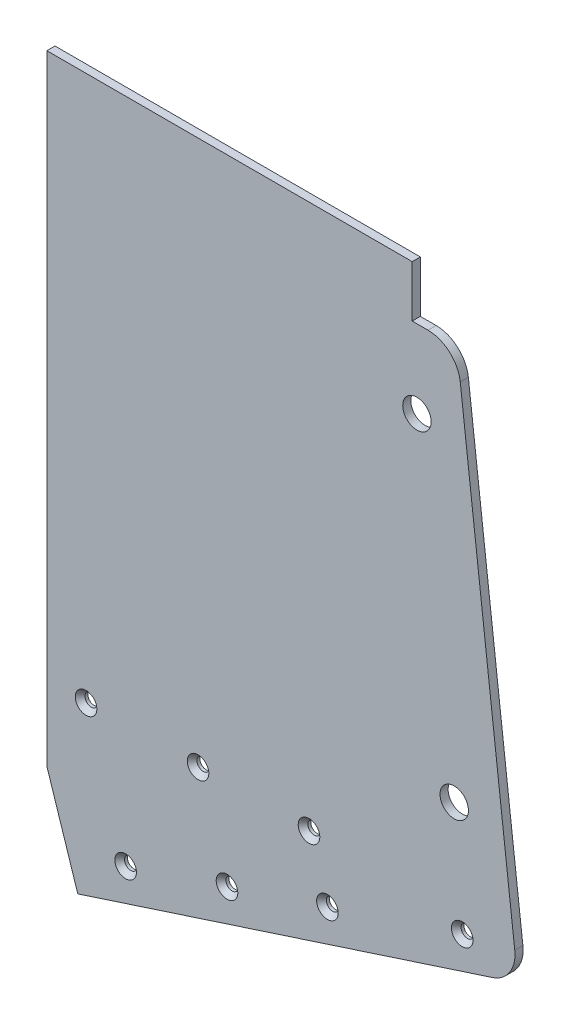
ISO-10303-21;
HEADER;
FILE_DESCRIPTION(('STEP AP214'),'2;1');
FILE_NAME('part.step','',(''),(''),'','','');
FILE_SCHEMA(('AUTOMOTIVE_DESIGN { 1 0 10303 214 1 1 1 1 }'));
ENDSEC;
DATA;
#1=APPLICATION_CONTEXT('core data for automotive mechanical design processes');
#2=APPLICATION_PROTOCOL_DEFINITION('international standard','automotive_design',2000,#1);
#3=PRODUCT_CONTEXT('',#1,'mechanical');
#4=PRODUCT('Part','Part','',(#3));
#5=PRODUCT_RELATED_PRODUCT_CATEGORY('part','',(#4));
#6=PRODUCT_DEFINITION_FORMATION('','',#4);
#7=PRODUCT_DEFINITION_CONTEXT('part definition',#1,'design');
#8=PRODUCT_DEFINITION('design','',#6,#7);
#9=PRODUCT_DEFINITION_SHAPE('','',#8);
#10=(LENGTH_UNIT() NAMED_UNIT(*) SI_UNIT(.MILLI.,.METRE.));
#11=(NAMED_UNIT(*) PLANE_ANGLE_UNIT() SI_UNIT($,.RADIAN.));
#12=(NAMED_UNIT(*) SI_UNIT($,.STERADIAN.) SOLID_ANGLE_UNIT());
#13=UNCERTAINTY_MEASURE_WITH_UNIT(LENGTH_MEASURE(1.E-05),#10,'distance_accuracy_value','');
#14=(GEOMETRIC_REPRESENTATION_CONTEXT(3) GLOBAL_UNCERTAINTY_ASSIGNED_CONTEXT((#13)) GLOBAL_UNIT_ASSIGNED_CONTEXT((#10,
#11,#12)) REPRESENTATION_CONTEXT('',''));
#15=CARTESIAN_POINT('',(0.,0.,0.));
#16=DIRECTION('',(0.,0.,1.));
#17=DIRECTION('',(1.,0.,0.));
#18=AXIS2_PLACEMENT_3D('',#15,#16,#17);
#19=CARTESIAN_POINT('',(-234.75296718065,12.6999999999995,-3.17500000000018));
#20=DIRECTION('',(1.,0.,0.));
#21=DIRECTION('',(0.,1.,0.));
#22=AXIS2_PLACEMENT_3D('',#19,#20,#21);
#23=PLANE('',#22);
#24=DIRECTION('',(0.,-1.,0.));
#25=VECTOR('',#24,1.);
#26=CARTESIAN_POINT('',(-234.75296718065,12.6999999999995,-7.49400541621981E-13));
#27=LINE('',#26,#25);
#28=CARTESIAN_POINT('',(-234.75296718065,12.6999999999995,-7.49400541621981E-13));
#29=VERTEX_POINT('',#28);
#30=CARTESIAN_POINT('',(-234.75296718065,-229.48555309758,0.));
#31=VERTEX_POINT('',#30);
#32=EDGE_CURVE('E114',#29,#31,#27,.T.);
#33=ORIENTED_EDGE('',*,*,#32,.F.);
#34=DIRECTION('',(0.,0.,1.));
#35=VECTOR('',#34,1.);
#36=CARTESIAN_POINT('',(-234.75296718065,12.6999999999995,-3.17500000000018));
#37=LINE('',#36,#35);
#38=CARTESIAN_POINT('',(-234.75296718065,12.6999999999995,-3.17500000000018));
#39=VERTEX_POINT('',#38);
#40=EDGE_CURVE('E141',#39,#29,#37,.T.);
#41=ORIENTED_EDGE('',*,*,#40,.F.);
#42=DIRECTION('',(0.,-1.,0.));
#43=VECTOR('',#42,1.);
#44=CARTESIAN_POINT('',(-234.75296718065,12.6999999999995,-3.17500000000018));
#45=LINE('',#44,#43);
#46=CARTESIAN_POINT('',(-234.75296718065,-229.48555309758,-3.17500000000004));
#47=VERTEX_POINT('',#46);
#48=EDGE_CURVE('E140',#39,#47,#45,.T.);
#49=ORIENTED_EDGE('',*,*,#48,.T.);
#50=DIRECTION('',(0.,0.,-1.));
#51=VECTOR('',#50,1.);
#52=CARTESIAN_POINT('',(-234.75296718065,-229.48555309758,0.));
#53=LINE('',#52,#51);
#54=EDGE_CURVE('E122',#31,#47,#53,.T.);
#55=ORIENTED_EDGE('',*,*,#54,.F.);
#56=EDGE_LOOP('',(#33,#41,#49,#55));
#57=FACE_BOUND('',#56,.T.);
#58=ADVANCED_FACE('F37',(#57),#23,.F.);
#59=CARTESIAN_POINT('',(-234.75296718065,-270.542758327655,-3.17499999999998));
#60=DIRECTION('',(-0.309324512684967,0.950956542567645,0.));
#61=DIRECTION('',(-0.950956542567645,-0.309324512684967,0.));
#62=AXIS2_PLACEMENT_3D('',#59,#60,#61);
#63=PLANE('',#62);
#64=DIRECTION('',(0.950956542567645,0.309324512684967,0.));
#65=VECTOR('',#64,1.);
#66=CARTESIAN_POINT('',(-234.75296718065,-270.542758327655,-3.17499999999998));
#67=LINE('',#66,#65);
#68=CARTESIAN_POINT('',(-222.675819090041,-266.614337016557,-3.17499999999998));
#69=VERTEX_POINT('',#68);
#70=CARTESIAN_POINT('',(-60.5974720840378,-213.893940804706,-3.17499999999965));
#71=VERTEX_POINT('',#70);
#72=EDGE_CURVE('E183',#69,#71,#67,.T.);
#73=ORIENTED_EDGE('',*,*,#72,.T.);
#74=DIRECTION('',(0.,0.,1.));
#75=VECTOR('',#74,1.);
#76=CARTESIAN_POINT('',(-60.5974720840378,-213.893940804706,-3.17499999999965));
#77=LINE('',#76,#75);
#78=CARTESIAN_POINT('',(-60.5974720840378,-213.893940804706,3.33066907387547E-13));
#79=VERTEX_POINT('',#78);
#80=EDGE_CURVE('E11',#79,#71,#77,.F.);
#81=ORIENTED_EDGE('',*,*,#80,.F.);
#82=DIRECTION('',(0.950956542567645,0.309324512684967,0.));
#83=VECTOR('',#82,1.);
#84=CARTESIAN_POINT('',(-234.75296718065,-270.542758327655,0.));
#85=LINE('',#84,#83);
#86=CARTESIAN_POINT('',(-222.675819090041,-266.614337016557,0.));
#87=VERTEX_POINT('',#86);
#88=EDGE_CURVE('E111',#87,#79,#85,.T.);
#89=ORIENTED_EDGE('',*,*,#88,.F.);
#90=DIRECTION('',(0.,0.,-1.));
#91=VECTOR('',#90,1.);
#92=CARTESIAN_POINT('',(-222.675819090041,-266.614337016557,0.));
#93=LINE('',#92,#91);
#94=EDGE_CURVE('E115',#87,#69,#93,.T.);
#95=ORIENTED_EDGE('',*,*,#94,.T.);
#96=EDGE_LOOP('',(#73,#81,#89,#95));
#97=FACE_BOUND('',#96,.T.);
#98=ADVANCED_FACE('F124',(#97),#63,.F.);
#99=CARTESIAN_POINT('',(-74.5334651306722,-7.41697903189298,-3.17499999999998));
#100=DIRECTION('',(-0.993195579602869,-0.11645832154604,0.));
#101=DIRECTION('',(0.11645832154604,-0.993195579602869,0.));
#102=AXIS2_PLACEMENT_3D('',#99,#100,#101);
#103=PLANE('',#102);
#104=DIRECTION('',(-0.11645832154604,0.993195579602869,0.));
#105=VECTOR('',#104,1.);
#106=CARTESIAN_POINT('',(-74.5334651306729,-7.4169790318932,0.));
#107=LINE('',#106,#105);
#108=CARTESIAN_POINT('',(-51.9123095341802,-200.337772030464,0.));
#109=VERTEX_POINT('',#108);
#110=CARTESIAN_POINT('',(-73.2177359388362,-18.6379583482581,7.49400541621981E-13));
#111=VERTEX_POINT('',#110);
#112=EDGE_CURVE('E125',#109,#111,#107,.T.);
#113=ORIENTED_EDGE('',*,*,#112,.F.);
#114=DIRECTION('',(0.,0.,1.));
#115=VECTOR('',#114,1.);
#116=CARTESIAN_POINT('',(-51.9123095341802,-200.337772030464,-3.17500000000004));
#117=LINE('',#116,#115);
#118=CARTESIAN_POINT('',(-51.9123095341802,-200.337772030464,-3.17500000000004));
#119=VERTEX_POINT('',#118);
#120=EDGE_CURVE('E158',#119,#109,#117,.T.);
#121=ORIENTED_EDGE('',*,*,#120,.F.);
#122=DIRECTION('',(-0.11645832154604,0.993195579602869,0.));
#123=VECTOR('',#122,1.);
#124=CARTESIAN_POINT('',(-74.5334651306722,-7.41697903189298,-3.17499999999998));
#125=LINE('',#124,#123);
#126=CARTESIAN_POINT('',(-73.217735938836,-18.6379583482581,-3.17499999999923));
#127=VERTEX_POINT('',#126);
#128=EDGE_CURVE('E180',#119,#127,#125,.T.);
#129=ORIENTED_EDGE('',*,*,#128,.T.);
#130=DIRECTION('',(0.,0.,1.));
#131=VECTOR('',#130,1.);
#132=CARTESIAN_POINT('',(-73.217735938836,-18.6379583482581,-3.17499999999923));
#133=LINE('',#132,#131);
#134=EDGE_CURVE('E161',#111,#127,#133,.F.);
#135=ORIENTED_EDGE('',*,*,#134,.F.);
#136=EDGE_LOOP('',(#113,#121,#129,#135));
#137=FACE_BOUND('',#136,.T.);
#138=ADVANCED_FACE('F290',(#137),#103,.F.);
#139=CARTESIAN_POINT('',(-74.5334651306722,-7.41697903189298,-3.17499999999998));
#140=DIRECTION('',(0.,-1.,0.));
#141=DIRECTION('',(1.,0.,0.));
#142=AXIS2_PLACEMENT_3D('',#139,#140,#141);
#143=PLANE('',#142);
#144=DIRECTION('',(-1.,0.,0.));
#145=VECTOR('',#144,1.);
#146=CARTESIAN_POINT('',(-74.5334651306722,-7.41697903189298,-3.17499999999998));
#147=LINE('',#146,#145);
#148=CARTESIAN_POINT('',(-85.8313197997923,-7.41697903189276,-3.17499999999998));
#149=VERTEX_POINT('',#148);
#150=CARTESIAN_POINT('',(-91.9973273926176,-7.41697903189453,-3.17499999999998));
#151=VERTEX_POINT('',#150);
#152=EDGE_CURVE('E174',#149,#151,#147,.T.);
#153=ORIENTED_EDGE('',*,*,#152,.T.);
#154=DIRECTION('',(0.,0.,1.));
#155=VECTOR('',#154,1.);
#156=CARTESIAN_POINT('',(-91.9973273926176,-7.41697903189453,-3.17499999999998));
#157=LINE('',#156,#155);
#158=CARTESIAN_POINT('',(-91.9973273926189,-7.41697903189342,0.));
#159=VERTEX_POINT('',#158);
#160=EDGE_CURVE('E148',#151,#159,#157,.T.);
#161=ORIENTED_EDGE('',*,*,#160,.T.);
#162=DIRECTION('',(-1.,0.,0.));
#163=VECTOR('',#162,1.);
#164=CARTESIAN_POINT('',(-74.5334651306729,-7.4169790318932,0.));
#165=LINE('',#164,#163);
#166=CARTESIAN_POINT('',(-85.8313197997922,-7.41697903189298,0.));
#167=VERTEX_POINT('',#166);
#168=EDGE_CURVE('E128',#167,#159,#165,.T.);
#169=ORIENTED_EDGE('',*,*,#168,.F.);
#170=DIRECTION('',(0.,0.,1.));
#171=VECTOR('',#170,1.);
#172=CARTESIAN_POINT('',(-85.8313197997923,-7.41697903189276,-3.17499999999998));
#173=LINE('',#172,#171);
#174=EDGE_CURVE('E151',#149,#167,#173,.T.);
#175=ORIENTED_EDGE('',*,*,#174,.F.);
#176=EDGE_LOOP('',(#153,#161,#169,#175));
#177=FACE_BOUND('',#176,.T.);
#178=ADVANCED_FACE('F173',(#177),#143,.F.);
#179=CARTESIAN_POINT('',(-91.9973273926176,-7.41697903189453,-3.17499999999998));
#180=DIRECTION('',(-1.,0.,0.));
#181=DIRECTION('',(0.,0.,-1.));
#182=AXIS2_PLACEMENT_3D('',#179,#180,#181);
#183=PLANE('',#182);
#184=DIRECTION('',(0.,1.,0.));
#185=VECTOR('',#184,1.);
#186=CARTESIAN_POINT('',(-91.9973273926189,-7.41697903189342,0.));
#187=LINE('',#186,#185);
#188=CARTESIAN_POINT('',(-91.9973273926187,12.6999999999988,0.));
#189=VERTEX_POINT('',#188);
#190=EDGE_CURVE('E135',#159,#189,#187,.T.);
#191=ORIENTED_EDGE('',*,*,#190,.F.);
#192=ORIENTED_EDGE('',*,*,#160,.F.);
#193=DIRECTION('',(0.,1.,0.));
#194=VECTOR('',#193,1.);
#195=CARTESIAN_POINT('',(-91.9973273926176,-7.41697903189453,-3.17499999999998));
#196=LINE('',#195,#194);
#197=CARTESIAN_POINT('',(-91.9973273926185,12.6999999999995,-3.17500000000004));
#198=VERTEX_POINT('',#197);
#199=EDGE_CURVE('E178',#151,#198,#196,.T.);
#200=ORIENTED_EDGE('',*,*,#199,.T.);
#201=DIRECTION('',(0.,0.,1.));
#202=VECTOR('',#201,1.);
#203=CARTESIAN_POINT('',(-91.9973273926185,12.6999999999995,-3.17500000000004));
#204=LINE('',#203,#202);
#205=EDGE_CURVE('E144',#198,#189,#204,.T.);
#206=ORIENTED_EDGE('',*,*,#205,.T.);
#207=EDGE_LOOP('',(#191,#192,#200,#206));
#208=FACE_BOUND('',#207,.T.);
#209=ADVANCED_FACE('F311',(#208),#183,.F.);
#210=CARTESIAN_POINT('',(-234.75296718065,12.6999999999995,-3.17500000000018));
#211=DIRECTION('',(0.,-1.,0.));
#212=DIRECTION('',(1.,0.,0.));
#213=AXIS2_PLACEMENT_3D('',#210,#211,#212);
#214=PLANE('',#213);
#215=DIRECTION('',(-1.,0.,0.));
#216=VECTOR('',#215,1.);
#217=CARTESIAN_POINT('',(-234.75296718065,12.6999999999995,-7.49400541621981E-13));
#218=LINE('',#217,#216);
#219=EDGE_CURVE('E138',#189,#29,#218,.T.);
#220=ORIENTED_EDGE('',*,*,#219,.F.);
#221=ORIENTED_EDGE('',*,*,#205,.F.);
#222=DIRECTION('',(-1.,0.,0.));
#223=VECTOR('',#222,1.);
#224=CARTESIAN_POINT('',(-234.75296718065,12.6999999999995,-3.17500000000018));
#225=LINE('',#224,#223);
#226=EDGE_CURVE('E145',#198,#39,#225,.T.);
#227=ORIENTED_EDGE('',*,*,#226,.T.);
#228=ORIENTED_EDGE('',*,*,#40,.T.);
#229=EDGE_LOOP('',(#220,#221,#227,#228));
#230=FACE_BOUND('',#229,.T.);
#231=ADVANCED_FACE('F188',(#230),#214,.F.);
#232=CARTESIAN_POINT('',(0.,0.,-3.17500000000004));
#233=DIRECTION('',(0.,0.,1.));
#234=DIRECTION('',(-1.,0.,0.));
#235=AXIS2_PLACEMENT_3D('',#232,#233,#234);
#236=PLANE('',#235);
#237=CARTESIAN_POINT('',(-90.1466019911953,-37.8407515828589,-3.17499999999923));
#238=DIRECTION('',(0.,0.,1.));
#239=DIRECTION('',(1.,0.,0.));
#240=AXIS2_PLACEMENT_3D('',#237,#238,#239);
#241=CIRCLE('',#240,5.55625);
#242=CARTESIAN_POINT('',(-84.5903519911953,-37.8407515828589,-3.17499999999923));
#243=VERTEX_POINT('',#242);
#244=EDGE_CURVE('E259',#243,#243,#241,.T.);
#245=ORIENTED_EDGE('',*,*,#244,.T.);
#246=EDGE_LOOP('',(#245));
#247=FACE_BOUND('',#246,.T.);
#248=CARTESIAN_POINT('',(-75.5766743950047,-162.097975038985,-3.1749999999994));
#249=DIRECTION('',(0.,0.,1.));
#250=DIRECTION('',(1.,0.,0.));
#251=AXIS2_PLACEMENT_3D('',#248,#249,#250);
#252=CIRCLE('',#251,5.55625);
#253=CARTESIAN_POINT('',(-70.0204243950047,-162.097975038985,-3.1749999999994));
#254=VERTEX_POINT('',#253);
#255=EDGE_CURVE('E263',#254,#254,#252,.T.);
#256=ORIENTED_EDGE('',*,*,#255,.T.);
#257=EDGE_LOOP('',(#256));
#258=FACE_BOUND('',#257,.T.);
#259=CARTESIAN_POINT('',(-203.969823430369,-247.917009556365,-3.17500000000073));
#260=DIRECTION('',(0.,0.,-1.));
#261=DIRECTION('',(-1.,0.,0.));
#262=AXIS2_PLACEMENT_3D('',#259,#260,#261);
#263=CIRCLE('',#262,2.45744999999994);
#264=CARTESIAN_POINT('',(-206.427273430369,-247.917009556365,-3.17500000000073));
#265=VERTEX_POINT('',#264);
#266=EDGE_CURVE('E250',#265,#265,#263,.T.);
#267=ORIENTED_EDGE('',*,*,#266,.F.);
#268=EDGE_LOOP('',(#267));
#269=FACE_BOUND('',#268,.T.);
#270=CARTESIAN_POINT('',(-164.368820636905,-235.035704951384,-3.17499999999957));
#271=DIRECTION('',(0.,0.,-1.));
#272=DIRECTION('',(-1.,0.,0.));
#273=AXIS2_PLACEMENT_3D('',#270,#271,#272);
#274=CIRCLE('',#273,2.45744999999994);
#275=CARTESIAN_POINT('',(-166.826270636905,-235.035704951384,-3.17499999999957));
#276=VERTEX_POINT('',#275);
#277=EDGE_CURVE('E241',#276,#276,#274,.T.);
#278=ORIENTED_EDGE('',*,*,#277,.F.);
#279=EDGE_LOOP('',(#278));
#280=FACE_BOUND('',#279,.T.);
#281=CARTESIAN_POINT('',(-175.687012216855,-200.240181507181,-3.17500000000062));
#282=DIRECTION('',(0.,0.,-1.));
#283=DIRECTION('',(-1.,0.,0.));
#284=AXIS2_PLACEMENT_3D('',#281,#282,#283);
#285=CIRCLE('',#284,2.45744999999994);
#286=CARTESIAN_POINT('',(-178.144462216855,-200.240181507181,-3.17500000000062));
#287=VERTEX_POINT('',#286);
#288=EDGE_CURVE('E232',#287,#287,#285,.T.);
#289=ORIENTED_EDGE('',*,*,#288,.F.);
#290=EDGE_LOOP('',(#289));
#291=FACE_BOUND('',#290,.T.);
#292=CARTESIAN_POINT('',(-219.438787807227,-200.360762709869,-3.17499999999998));
#293=DIRECTION('',(0.,0.,-1.));
#294=DIRECTION('',(-1.,0.,0.));
#295=AXIS2_PLACEMENT_3D('',#292,#293,#294);
#296=CIRCLE('',#295,2.45744999999994);
#297=CARTESIAN_POINT('',(-221.896237807227,-200.360762709869,-3.17499999999998));
#298=VERTEX_POINT('',#297);
#299=EDGE_CURVE('E223',#298,#298,#296,.T.);
#300=ORIENTED_EDGE('',*,*,#299,.F.);
#301=EDGE_LOOP('',(#300));
#302=FACE_BOUND('',#301,.T.);
#303=CARTESIAN_POINT('',(-125.118089342419,-222.268335690299,-3.17499999999998));
#304=DIRECTION('',(0.,0.,-1.));
#305=DIRECTION('',(-1.,0.,0.));
#306=AXIS2_PLACEMENT_3D('',#303,#304,#305);
#307=CIRCLE('',#306,2.45744999999994);
#308=CARTESIAN_POINT('',(-127.575539342419,-222.268335690299,-3.17499999999998));
#309=VERTEX_POINT('',#308);
#310=EDGE_CURVE('E214',#309,#309,#307,.T.);
#311=ORIENTED_EDGE('',*,*,#310,.F.);
#312=EDGE_LOOP('',(#311));
#313=FACE_BOUND('',#312,.T.);
#314=CARTESIAN_POINT('',(-132.322221776818,-200.12066684715,-3.17499999999935));
#315=DIRECTION('',(0.,0.,-1.));
#316=DIRECTION('',(-1.,0.,0.));
#317=AXIS2_PLACEMENT_3D('',#314,#315,#316);
#318=CIRCLE('',#317,2.45744999999994);
#319=CARTESIAN_POINT('',(-134.779671776818,-200.12066684715,-3.17499999999935));
#320=VERTEX_POINT('',#319);
#321=EDGE_CURVE('E205',#320,#320,#318,.T.);
#322=ORIENTED_EDGE('',*,*,#321,.F.);
#323=EDGE_LOOP('',(#322));
#324=FACE_BOUND('',#323,.T.);
#325=CARTESIAN_POINT('',(-72.4520660391997,-205.137277367341,-3.17499999999998));
#326=DIRECTION('',(0.,0.,-1.));
#327=DIRECTION('',(-1.,0.,0.));
#328=AXIS2_PLACEMENT_3D('',#325,#326,#327);
#329=CIRCLE('',#328,2.45744999999994);
#330=CARTESIAN_POINT('',(-74.9095160391996,-205.137277367341,-3.17499999999998));
#331=VERTEX_POINT('',#330);
#332=EDGE_CURVE('E195',#331,#331,#329,.T.);
#333=ORIENTED_EDGE('',*,*,#332,.F.);
#334=EDGE_LOOP('',(#333));
#335=FACE_BOUND('',#334,.T.);
#336=ORIENTED_EDGE('',*,*,#48,.F.);
#337=ORIENTED_EDGE('',*,*,#226,.F.);
#338=ORIENTED_EDGE('',*,*,#199,.F.);
#339=ORIENTED_EDGE('',*,*,#152,.F.);
#340=CARTESIAN_POINT('',(-85.8313197997911,-20.1169790318934,-3.17499999999998));
#341=DIRECTION('',(0.,0.,-1.));
#342=DIRECTION('',(-1.,0.,0.));
#343=AXIS2_PLACEMENT_3D('',#340,#341,#342);
#344=CIRCLE('',#343,12.7);
#345=EDGE_CURVE('E45',#127,#149,#344,.F.);
#346=ORIENTED_EDGE('',*,*,#345,.F.);
#347=ORIENTED_EDGE('',*,*,#128,.F.);
#348=CARTESIAN_POINT('',(-64.5258933951369,-201.816792714098,-3.17499999999965));
#349=DIRECTION('',(0.,0.,-1.));
#350=DIRECTION('',(-1.,0.,0.));
#351=AXIS2_PLACEMENT_3D('',#348,#349,#350);
#352=CIRCLE('',#351,12.7);
#353=EDGE_CURVE('E60',#71,#119,#352,.F.);
#354=ORIENTED_EDGE('',*,*,#353,.F.);
#355=ORIENTED_EDGE('',*,*,#72,.F.);
#356=DIRECTION('',(-0.309324512684967,0.950956542567644,0.));
#357=VECTOR('',#356,1.);
#358=CARTESIAN_POINT('',(-222.675819090041,-266.614337016557,-3.17499999999998));
#359=LINE('',#358,#357);
#360=EDGE_CURVE('E116',#69,#47,#359,.T.);
#361=ORIENTED_EDGE('',*,*,#360,.T.);
#362=EDGE_LOOP('',(#336,#337,#338,#339,#346,#347,#354,#355,#361));
#363=FACE_BOUND('',#362,.T.);
#364=ADVANCED_FACE('F176',(#247,#258,#269,#280,#291,#302,#313,#324,#335,#363),#236,.F.);
#365=CARTESIAN_POINT('',(0.,0.,0.));
#366=DIRECTION('',(0.,0.,1.));
#367=DIRECTION('',(-1.,0.,0.));
#368=AXIS2_PLACEMENT_3D('',#365,#366,#367);
#369=PLANE('',#368);
#370=CARTESIAN_POINT('',(-90.1466019911967,-37.8407515828587,7.49400541621981E-13));
#371=DIRECTION('',(0.,0.,-1.));
#372=DIRECTION('',(-1.,0.,0.));
#373=AXIS2_PLACEMENT_3D('',#370,#371,#372);
#374=CIRCLE('',#373,5.55625);
#375=CARTESIAN_POINT('',(-95.7028519911967,-37.8407515828587,7.49400541621981E-13));
#376=VERTEX_POINT('',#375);
#377=EDGE_CURVE('E266',#376,#376,#374,.F.);
#378=ORIENTED_EDGE('',*,*,#377,.F.);
#379=EDGE_LOOP('',(#378));
#380=FACE_BOUND('',#379,.T.);
#381=CARTESIAN_POINT('',(-75.5766743950047,-162.097975038985,6.38378239159465E-13));
#382=DIRECTION('',(0.,0.,-1.));
#383=DIRECTION('',(-1.,0.,0.));
#384=AXIS2_PLACEMENT_3D('',#381,#382,#383);
#385=CIRCLE('',#384,5.55625);
#386=CARTESIAN_POINT('',(-81.1329243950047,-162.097975038985,6.38378239159465E-13));
#387=VERTEX_POINT('',#386);
#388=EDGE_CURVE('E260',#387,#387,#385,.F.);
#389=ORIENTED_EDGE('',*,*,#388,.F.);
#390=EDGE_LOOP('',(#389));
#391=FACE_BOUND('',#390,.T.);
#392=CARTESIAN_POINT('',(-203.969823430369,-247.917009556365,-7.49400541621981E-13));
#393=DIRECTION('',(0.,0.,-1.));
#394=DIRECTION('',(-1.,0.,0.));
#395=AXIS2_PLACEMENT_3D('',#392,#393,#394);
#396=CIRCLE('',#395,4.21640000000001);
#397=CARTESIAN_POINT('',(-208.186223430369,-247.917009556365,-7.49400541621981E-13));
#398=VERTEX_POINT('',#397);
#399=EDGE_CURVE('E256',#398,#398,#396,.T.);
#400=ORIENTED_EDGE('',*,*,#399,.T.);
#401=EDGE_LOOP('',(#400));
#402=FACE_BOUND('',#401,.T.);
#403=CARTESIAN_POINT('',(-164.368820636905,-235.035704951384,4.16333634234434E-13));
#404=DIRECTION('',(0.,0.,-1.));
#405=DIRECTION('',(-1.,0.,0.));
#406=AXIS2_PLACEMENT_3D('',#403,#404,#405);
#407=CIRCLE('',#406,4.21640000000001);
#408=CARTESIAN_POINT('',(-168.585220636905,-235.035704951384,4.16333634234434E-13));
#409=VERTEX_POINT('',#408);
#410=EDGE_CURVE('E247',#409,#409,#407,.T.);
#411=ORIENTED_EDGE('',*,*,#410,.T.);
#412=EDGE_LOOP('',(#411));
#413=FACE_BOUND('',#412,.T.);
#414=CARTESIAN_POINT('',(-175.687012216855,-200.240181507181,-6.38378239159465E-13));
#415=DIRECTION('',(0.,0.,-1.));
#416=DIRECTION('',(-1.,0.,0.));
#417=AXIS2_PLACEMENT_3D('',#414,#415,#416);
#418=CIRCLE('',#417,4.21640000000001);
#419=CARTESIAN_POINT('',(-179.903412216855,-200.240181507181,-6.38378239159465E-13));
#420=VERTEX_POINT('',#419);
#421=EDGE_CURVE('E238',#420,#420,#418,.T.);
#422=ORIENTED_EDGE('',*,*,#421,.T.);
#423=EDGE_LOOP('',(#422));
#424=FACE_BOUND('',#423,.T.);
#425=CARTESIAN_POINT('',(-219.438787807227,-200.360762709869,0.));
#426=DIRECTION('',(0.,0.,-1.));
#427=DIRECTION('',(-1.,0.,0.));
#428=AXIS2_PLACEMENT_3D('',#425,#426,#427);
#429=CIRCLE('',#428,4.21640000000001);
#430=CARTESIAN_POINT('',(-223.655187807227,-200.360762709869,0.));
#431=VERTEX_POINT('',#430);
#432=EDGE_CURVE('E229',#431,#431,#429,.T.);
#433=ORIENTED_EDGE('',*,*,#432,.T.);
#434=EDGE_LOOP('',(#433));
#435=FACE_BOUND('',#434,.T.);
#436=CARTESIAN_POINT('',(-125.118089342419,-222.268335690299,0.));
#437=DIRECTION('',(0.,0.,-1.));
#438=DIRECTION('',(-1.,0.,0.));
#439=AXIS2_PLACEMENT_3D('',#436,#437,#438);
#440=CIRCLE('',#439,4.21639999999999);
#441=CARTESIAN_POINT('',(-129.334489342419,-222.268335690299,0.));
#442=VERTEX_POINT('',#441);
#443=EDGE_CURVE('E220',#442,#442,#440,.T.);
#444=ORIENTED_EDGE('',*,*,#443,.T.);
#445=EDGE_LOOP('',(#444));
#446=FACE_BOUND('',#445,.T.);
#447=CARTESIAN_POINT('',(-132.322221776818,-200.12066684715,6.38378239159465E-13));
#448=DIRECTION('',(0.,0.,-1.));
#449=DIRECTION('',(-1.,0.,0.));
#450=AXIS2_PLACEMENT_3D('',#447,#448,#449);
#451=CIRCLE('',#450,4.21640000000001);
#452=CARTESIAN_POINT('',(-136.538621776818,-200.12066684715,6.38378239159465E-13));
#453=VERTEX_POINT('',#452);
#454=EDGE_CURVE('E211',#453,#453,#451,.T.);
#455=ORIENTED_EDGE('',*,*,#454,.T.);
#456=EDGE_LOOP('',(#455));
#457=FACE_BOUND('',#456,.T.);
#458=CARTESIAN_POINT('',(-72.4520660391997,-205.137277367341,0.));
#459=DIRECTION('',(0.,0.,-1.));
#460=DIRECTION('',(-1.,0.,0.));
#461=AXIS2_PLACEMENT_3D('',#458,#459,#460);
#462=CIRCLE('',#461,4.21639999999999);
#463=CARTESIAN_POINT('',(-76.6684660391997,-205.137277367341,0.));
#464=VERTEX_POINT('',#463);
#465=EDGE_CURVE('E202',#464,#464,#462,.T.);
#466=ORIENTED_EDGE('',*,*,#465,.T.);
#467=EDGE_LOOP('',(#466));
#468=FACE_BOUND('',#467,.T.);
#469=DIRECTION('',(-0.309324512684967,0.950956542567644,0.));
#470=VECTOR('',#469,1.);
#471=CARTESIAN_POINT('',(-222.675819090041,-266.614337016557,0.));
#472=LINE('',#471,#470);
#473=EDGE_CURVE('E52',#87,#31,#472,.T.);
#474=ORIENTED_EDGE('',*,*,#473,.F.);
#475=ORIENTED_EDGE('',*,*,#88,.T.);
#476=CARTESIAN_POINT('',(-64.5258933951369,-201.816792714098,3.33066907387547E-13));
#477=DIRECTION('',(0.,0.,-1.));
#478=DIRECTION('',(-1.,0.,0.));
#479=AXIS2_PLACEMENT_3D('',#476,#477,#478);
#480=CIRCLE('',#479,12.7);
#481=EDGE_CURVE('E154',#109,#79,#480,.T.);
#482=ORIENTED_EDGE('',*,*,#481,.F.);
#483=ORIENTED_EDGE('',*,*,#112,.T.);
#484=CARTESIAN_POINT('',(-85.8313197997921,-20.1169790318938,0.));
#485=DIRECTION('',(0.,0.,-1.));
#486=DIRECTION('',(-1.,0.,0.));
#487=AXIS2_PLACEMENT_3D('',#484,#485,#486);
#488=CIRCLE('',#487,12.7);
#489=EDGE_CURVE('E156',#167,#111,#488,.T.);
#490=ORIENTED_EDGE('',*,*,#489,.F.);
#491=ORIENTED_EDGE('',*,*,#168,.T.);
#492=ORIENTED_EDGE('',*,*,#190,.T.);
#493=ORIENTED_EDGE('',*,*,#219,.T.);
#494=ORIENTED_EDGE('',*,*,#32,.T.);
#495=EDGE_LOOP('',(#474,#475,#482,#483,#490,#491,#492,#493,#494));
#496=FACE_BOUND('',#495,.T.);
#497=ADVANCED_FACE('F109',(#380,#391,#402,#413,#424,#435,#446,#457,#468,#496),#369,.T.);
#498=CARTESIAN_POINT('',(-85.8313197997911,-20.1169790318934,-3.17499999999998));
#499=DIRECTION('',(0.,0.,1.));
#500=DIRECTION('',(-1.,0.,0.));
#501=AXIS2_PLACEMENT_3D('',#498,#499,#500);
#502=CYLINDRICAL_SURFACE('',#501,12.7);
#503=ORIENTED_EDGE('',*,*,#345,.T.);
#504=ORIENTED_EDGE('',*,*,#174,.T.);
#505=ORIENTED_EDGE('',*,*,#489,.T.);
#506=ORIENTED_EDGE('',*,*,#134,.T.);
#507=EDGE_LOOP('',(#503,#504,#505,#506));
#508=FACE_BOUND('',#507,.T.);
#509=ADVANCED_FACE('F166',(#508),#502,.T.);
#510=CARTESIAN_POINT('',(-64.5258933951369,-201.816792714098,-3.17499999999965));
#511=DIRECTION('',(0.,0.,1.));
#512=DIRECTION('',(-1.,0.,0.));
#513=AXIS2_PLACEMENT_3D('',#510,#511,#512);
#514=CYLINDRICAL_SURFACE('',#513,12.7);
#515=ORIENTED_EDGE('',*,*,#353,.T.);
#516=ORIENTED_EDGE('',*,*,#120,.T.);
#517=ORIENTED_EDGE('',*,*,#481,.T.);
#518=ORIENTED_EDGE('',*,*,#80,.T.);
#519=EDGE_LOOP('',(#515,#516,#517,#518));
#520=FACE_BOUND('',#519,.T.);
#521=ADVANCED_FACE('F39',(#520),#514,.T.);
#522=CARTESIAN_POINT('',(-222.675819090041,-266.614337016557,0.));
#523=DIRECTION('',(0.950956542567645,0.309324512684967,0.));
#524=DIRECTION('',(-0.309324512684967,0.950956542567645,0.));
#525=AXIS2_PLACEMENT_3D('',#522,#523,#524);
#526=PLANE('',#525);
#527=ORIENTED_EDGE('',*,*,#360,.F.);
#528=ORIENTED_EDGE('',*,*,#94,.F.);
#529=ORIENTED_EDGE('',*,*,#473,.T.);
#530=ORIENTED_EDGE('',*,*,#54,.T.);
#531=EDGE_LOOP('',(#527,#528,#529,#530));
#532=FACE_BOUND('',#531,.T.);
#533=ADVANCED_FACE('F119',(#532),#526,.F.);
#534=CARTESIAN_POINT('',(-72.4520660391997,-205.137277367341,0.));
#535=DIRECTION('',(0.,0.,1.));
#536=DIRECTION('',(-1.,0.,0.));
#537=AXIS2_PLACEMENT_3D('',#534,#535,#536);
#538=CYLINDRICAL_SURFACE('',#537,2.45744999999994);
#539=ORIENTED_EDGE('',*,*,#332,.T.);
#540=EDGE_LOOP('',(#539));
#541=FACE_BOUND('',#540,.T.);
#542=CARTESIAN_POINT('',(-72.4520660391997,-205.137277367341,-2.02344050988146));
#543=DIRECTION('',(0.,0.,-1.));
#544=DIRECTION('',(-1.,0.,0.));
#545=AXIS2_PLACEMENT_3D('',#542,#543,#544);
#546=CIRCLE('',#545,2.45744999999994);
#547=CARTESIAN_POINT('',(-74.9095160391996,-205.137277367341,-2.02344050988146));
#548=VERTEX_POINT('',#547);
#549=EDGE_CURVE('E199',#548,#548,#546,.T.);
#550=ORIENTED_EDGE('',*,*,#549,.F.);
#551=EDGE_LOOP('',(#550));
#552=FACE_BOUND('',#551,.T.);
#553=ADVANCED_FACE('F363',(#541,#552),#538,.F.);
#554=CARTESIAN_POINT('',(-72.4520660391997,-205.137277367341,0.));
#555=DIRECTION('',(0.,0.,1.));
#556=DIRECTION('',(-1.,0.,0.));
#557=AXIS2_PLACEMENT_3D('',#554,#555,#556);
#558=CONICAL_SURFACE('',#557,4.21639999999999,0.715584993317674);
#559=ORIENTED_EDGE('',*,*,#549,.T.);
#560=EDGE_LOOP('',(#559));
#561=FACE_BOUND('',#560,.T.);
#562=ORIENTED_EDGE('',*,*,#465,.F.);
#563=EDGE_LOOP('',(#562));
#564=FACE_BOUND('',#563,.T.);
#565=ADVANCED_FACE('F371',(#561,#564),#558,.F.);
#566=CARTESIAN_POINT('',(-132.322221776818,-200.12066684715,6.38378239159465E-13));
#567=DIRECTION('',(0.,0.,1.));
#568=DIRECTION('',(-1.,0.,0.));
#569=AXIS2_PLACEMENT_3D('',#566,#567,#568);
#570=CYLINDRICAL_SURFACE('',#569,2.45744999999994);
#571=ORIENTED_EDGE('',*,*,#321,.T.);
#572=EDGE_LOOP('',(#571));
#573=FACE_BOUND('',#572,.T.);
#574=CARTESIAN_POINT('',(-132.322221776818,-200.12066684715,-2.02344050988082));
#575=DIRECTION('',(0.,0.,-1.));
#576=DIRECTION('',(-1.,0.,0.));
#577=AXIS2_PLACEMENT_3D('',#574,#575,#576);
#578=CIRCLE('',#577,2.45744999999994);
#579=CARTESIAN_POINT('',(-134.779671776818,-200.12066684715,-2.02344050988082));
#580=VERTEX_POINT('',#579);
#581=EDGE_CURVE('E208',#580,#580,#578,.T.);
#582=ORIENTED_EDGE('',*,*,#581,.F.);
#583=EDGE_LOOP('',(#582));
#584=FACE_BOUND('',#583,.T.);
#585=ADVANCED_FACE('F381',(#573,#584),#570,.F.);
#586=CARTESIAN_POINT('',(-132.322221776818,-200.12066684715,6.38378239159465E-13));
#587=DIRECTION('',(0.,0.,1.));
#588=DIRECTION('',(-1.,0.,0.));
#589=AXIS2_PLACEMENT_3D('',#586,#587,#588);
#590=CONICAL_SURFACE('',#589,4.21640000000001,0.715584993317677);
#591=ORIENTED_EDGE('',*,*,#581,.T.);
#592=EDGE_LOOP('',(#591));
#593=FACE_BOUND('',#592,.T.);
#594=ORIENTED_EDGE('',*,*,#454,.F.);
#595=EDGE_LOOP('',(#594));
#596=FACE_BOUND('',#595,.T.);
#597=ADVANCED_FACE('F391',(#593,#596),#590,.F.);
#598=CARTESIAN_POINT('',(-125.118089342419,-222.268335690299,0.));
#599=DIRECTION('',(0.,0.,1.));
#600=DIRECTION('',(-1.,0.,0.));
#601=AXIS2_PLACEMENT_3D('',#598,#599,#600);
#602=CYLINDRICAL_SURFACE('',#601,2.45744999999994);
#603=ORIENTED_EDGE('',*,*,#310,.T.);
#604=EDGE_LOOP('',(#603));
#605=FACE_BOUND('',#604,.T.);
#606=CARTESIAN_POINT('',(-125.118089342419,-222.268335690299,-2.02344050988146));
#607=DIRECTION('',(0.,0.,-1.));
#608=DIRECTION('',(-1.,0.,0.));
#609=AXIS2_PLACEMENT_3D('',#606,#607,#608);
#610=CIRCLE('',#609,2.45744999999994);
#611=CARTESIAN_POINT('',(-127.575539342419,-222.268335690299,-2.02344050988146));
#612=VERTEX_POINT('',#611);
#613=EDGE_CURVE('E217',#612,#612,#610,.T.);
#614=ORIENTED_EDGE('',*,*,#613,.F.);
#615=EDGE_LOOP('',(#614));
#616=FACE_BOUND('',#615,.T.);
#617=ADVANCED_FACE('F401',(#605,#616),#602,.F.);
#618=CARTESIAN_POINT('',(-125.118089342419,-222.268335690299,0.));
#619=DIRECTION('',(0.,0.,1.));
#620=DIRECTION('',(-1.,0.,0.));
#621=AXIS2_PLACEMENT_3D('',#618,#619,#620);
#622=CONICAL_SURFACE('',#621,4.21639999999999,0.715584993317674);
#623=ORIENTED_EDGE('',*,*,#613,.T.);
#624=EDGE_LOOP('',(#623));
#625=FACE_BOUND('',#624,.T.);
#626=ORIENTED_EDGE('',*,*,#443,.F.);
#627=EDGE_LOOP('',(#626));
#628=FACE_BOUND('',#627,.T.);
#629=ADVANCED_FACE('F411',(#625,#628),#622,.F.);
#630=CARTESIAN_POINT('',(-219.438787807227,-200.360762709869,0.));
#631=DIRECTION('',(0.,0.,1.));
#632=DIRECTION('',(-1.,0.,0.));
#633=AXIS2_PLACEMENT_3D('',#630,#631,#632);
#634=CYLINDRICAL_SURFACE('',#633,2.45744999999994);
#635=ORIENTED_EDGE('',*,*,#299,.T.);
#636=EDGE_LOOP('',(#635));
#637=FACE_BOUND('',#636,.T.);
#638=CARTESIAN_POINT('',(-219.438787807227,-200.360762709869,-2.02344050988146));
#639=DIRECTION('',(0.,0.,-1.));
#640=DIRECTION('',(-1.,0.,0.));
#641=AXIS2_PLACEMENT_3D('',#638,#639,#640);
#642=CIRCLE('',#641,2.45744999999994);
#643=CARTESIAN_POINT('',(-221.896237807227,-200.360762709869,-2.02344050988146));
#644=VERTEX_POINT('',#643);
#645=EDGE_CURVE('E226',#644,#644,#642,.T.);
#646=ORIENTED_EDGE('',*,*,#645,.F.);
#647=EDGE_LOOP('',(#646));
#648=FACE_BOUND('',#647,.T.);
#649=ADVANCED_FACE('F421',(#637,#648),#634,.F.);
#650=CARTESIAN_POINT('',(-219.438787807227,-200.360762709869,0.));
#651=DIRECTION('',(0.,0.,1.));
#652=DIRECTION('',(-1.,0.,0.));
#653=AXIS2_PLACEMENT_3D('',#650,#651,#652);
#654=CONICAL_SURFACE('',#653,4.21640000000001,0.715584993317677);
#655=ORIENTED_EDGE('',*,*,#645,.T.);
#656=EDGE_LOOP('',(#655));
#657=FACE_BOUND('',#656,.T.);
#658=ORIENTED_EDGE('',*,*,#432,.F.);
#659=EDGE_LOOP('',(#658));
#660=FACE_BOUND('',#659,.T.);
#661=ADVANCED_FACE('F431',(#657,#660),#654,.F.);
#662=CARTESIAN_POINT('',(-175.687012216855,-200.240181507181,-6.38378239159465E-13));
#663=DIRECTION('',(0.,0.,1.));
#664=DIRECTION('',(-1.,0.,0.));
#665=AXIS2_PLACEMENT_3D('',#662,#663,#664);
#666=CYLINDRICAL_SURFACE('',#665,2.45744999999994);
#667=ORIENTED_EDGE('',*,*,#288,.T.);
#668=EDGE_LOOP('',(#667));
#669=FACE_BOUND('',#668,.T.);
#670=CARTESIAN_POINT('',(-175.687012216855,-200.240181507181,-2.0234405098821));
#671=DIRECTION('',(0.,0.,-1.));
#672=DIRECTION('',(-1.,0.,0.));
#673=AXIS2_PLACEMENT_3D('',#670,#671,#672);
#674=CIRCLE('',#673,2.45744999999994);
#675=CARTESIAN_POINT('',(-178.144462216855,-200.240181507181,-2.0234405098821));
#676=VERTEX_POINT('',#675);
#677=EDGE_CURVE('E235',#676,#676,#674,.T.);
#678=ORIENTED_EDGE('',*,*,#677,.F.);
#679=EDGE_LOOP('',(#678));
#680=FACE_BOUND('',#679,.T.);
#681=ADVANCED_FACE('F441',(#669,#680),#666,.F.);
#682=CARTESIAN_POINT('',(-175.687012216855,-200.240181507181,-6.38378239159465E-13));
#683=DIRECTION('',(0.,0.,1.));
#684=DIRECTION('',(-1.,0.,0.));
#685=AXIS2_PLACEMENT_3D('',#682,#683,#684);
#686=CONICAL_SURFACE('',#685,4.21640000000001,0.715584993317677);
#687=ORIENTED_EDGE('',*,*,#677,.T.);
#688=EDGE_LOOP('',(#687));
#689=FACE_BOUND('',#688,.T.);
#690=ORIENTED_EDGE('',*,*,#421,.F.);
#691=EDGE_LOOP('',(#690));
#692=FACE_BOUND('',#691,.T.);
#693=ADVANCED_FACE('F451',(#689,#692),#686,.F.);
#694=CARTESIAN_POINT('',(-164.368820636905,-235.035704951384,4.16333634234434E-13));
#695=DIRECTION('',(0.,0.,1.));
#696=DIRECTION('',(-1.,0.,0.));
#697=AXIS2_PLACEMENT_3D('',#694,#695,#696);
#698=CYLINDRICAL_SURFACE('',#697,2.45744999999994);
#699=ORIENTED_EDGE('',*,*,#277,.T.);
#700=EDGE_LOOP('',(#699));
#701=FACE_BOUND('',#700,.T.);
#702=CARTESIAN_POINT('',(-164.368820636905,-235.035704951384,-2.02344050988104));
#703=DIRECTION('',(0.,0.,-1.));
#704=DIRECTION('',(-1.,0.,0.));
#705=AXIS2_PLACEMENT_3D('',#702,#703,#704);
#706=CIRCLE('',#705,2.45744999999994);
#707=CARTESIAN_POINT('',(-166.826270636905,-235.035704951384,-2.02344050988104));
#708=VERTEX_POINT('',#707);
#709=EDGE_CURVE('E244',#708,#708,#706,.T.);
#710=ORIENTED_EDGE('',*,*,#709,.F.);
#711=EDGE_LOOP('',(#710));
#712=FACE_BOUND('',#711,.T.);
#713=ADVANCED_FACE('F461',(#701,#712),#698,.F.);
#714=CARTESIAN_POINT('',(-164.368820636905,-235.035704951384,4.16333634234434E-13));
#715=DIRECTION('',(0.,0.,1.));
#716=DIRECTION('',(-1.,0.,0.));
#717=AXIS2_PLACEMENT_3D('',#714,#715,#716);
#718=CONICAL_SURFACE('',#717,4.21640000000001,0.715584993317677);
#719=ORIENTED_EDGE('',*,*,#709,.T.);
#720=EDGE_LOOP('',(#719));
#721=FACE_BOUND('',#720,.T.);
#722=ORIENTED_EDGE('',*,*,#410,.F.);
#723=EDGE_LOOP('',(#722));
#724=FACE_BOUND('',#723,.T.);
#725=ADVANCED_FACE('F471',(#721,#724),#718,.F.);
#726=CARTESIAN_POINT('',(-203.969823430369,-247.917009556365,-7.49400541621981E-13));
#727=DIRECTION('',(0.,0.,1.));
#728=DIRECTION('',(-1.,0.,0.));
#729=AXIS2_PLACEMENT_3D('',#726,#727,#728);
#730=CYLINDRICAL_SURFACE('',#729,2.45744999999994);
#731=ORIENTED_EDGE('',*,*,#266,.T.);
#732=EDGE_LOOP('',(#731));
#733=FACE_BOUND('',#732,.T.);
#734=CARTESIAN_POINT('',(-203.969823430369,-247.917009556365,-2.02344050988221));
#735=DIRECTION('',(0.,0.,-1.));
#736=DIRECTION('',(-1.,0.,0.));
#737=AXIS2_PLACEMENT_3D('',#734,#735,#736);
#738=CIRCLE('',#737,2.45744999999994);
#739=CARTESIAN_POINT('',(-206.427273430369,-247.917009556365,-2.02344050988221));
#740=VERTEX_POINT('',#739);
#741=EDGE_CURVE('E253',#740,#740,#738,.T.);
#742=ORIENTED_EDGE('',*,*,#741,.F.);
#743=EDGE_LOOP('',(#742));
#744=FACE_BOUND('',#743,.T.);
#745=ADVANCED_FACE('F481',(#733,#744),#730,.F.);
#746=CARTESIAN_POINT('',(-203.969823430369,-247.917009556365,-7.49400541621981E-13));
#747=DIRECTION('',(0.,0.,1.));
#748=DIRECTION('',(-1.,0.,0.));
#749=AXIS2_PLACEMENT_3D('',#746,#747,#748);
#750=CONICAL_SURFACE('',#749,4.21640000000001,0.715584993317677);
#751=ORIENTED_EDGE('',*,*,#741,.T.);
#752=EDGE_LOOP('',(#751));
#753=FACE_BOUND('',#752,.T.);
#754=ORIENTED_EDGE('',*,*,#399,.F.);
#755=EDGE_LOOP('',(#754));
#756=FACE_BOUND('',#755,.T.);
#757=ADVANCED_FACE('F282',(#753,#756),#750,.F.);
#758=CARTESIAN_POINT('',(-75.5766743950047,-162.097975038985,0.00100000000061162));
#759=DIRECTION('',(0.,0.,-1.));
#760=DIRECTION('',(1.,0.,0.));
#761=AXIS2_PLACEMENT_3D('',#758,#759,#760);
#762=CYLINDRICAL_SURFACE('',#761,5.55625);
#763=ORIENTED_EDGE('',*,*,#388,.T.);
#764=EDGE_LOOP('',(#763));
#765=FACE_BOUND('',#764,.T.);
#766=ORIENTED_EDGE('',*,*,#255,.F.);
#767=EDGE_LOOP('',(#766));
#768=FACE_BOUND('',#767,.T.);
#769=ADVANCED_FACE('F276',(#765,#768),#762,.F.);
#770=CARTESIAN_POINT('',(-90.1466019911967,-37.8407515828587,0.00100000000077816));
#771=DIRECTION('',(0.,0.,-1.));
#772=DIRECTION('',(1.,0.,0.));
#773=AXIS2_PLACEMENT_3D('',#770,#771,#772);
#774=CYLINDRICAL_SURFACE('',#773,5.55625);
#775=ORIENTED_EDGE('',*,*,#377,.T.);
#776=EDGE_LOOP('',(#775));
#777=FACE_BOUND('',#776,.T.);
#778=ORIENTED_EDGE('',*,*,#244,.F.);
#779=EDGE_LOOP('',(#778));
#780=FACE_BOUND('',#779,.T.);
#781=ADVANCED_FACE('F274',(#777,#780),#774,.F.);
#782=CLOSED_SHELL('',(#58,#98,#138,#178,#209,#231,#364,#497,#509,#521,#533,#553,#565,#585,#597,
#617,#629,#649,#661,#681,#693,#713,#725,#745,#757,#769,#781));
#783=MANIFOLD_SOLID_BREP('B2',#782);
#784=ADVANCED_BREP_SHAPE_REPRESENTATION('',(#18,#783),#14);
#785=SHAPE_DEFINITION_REPRESENTATION(#9,#784);
ENDSEC;
END-ISO-10303-21;
